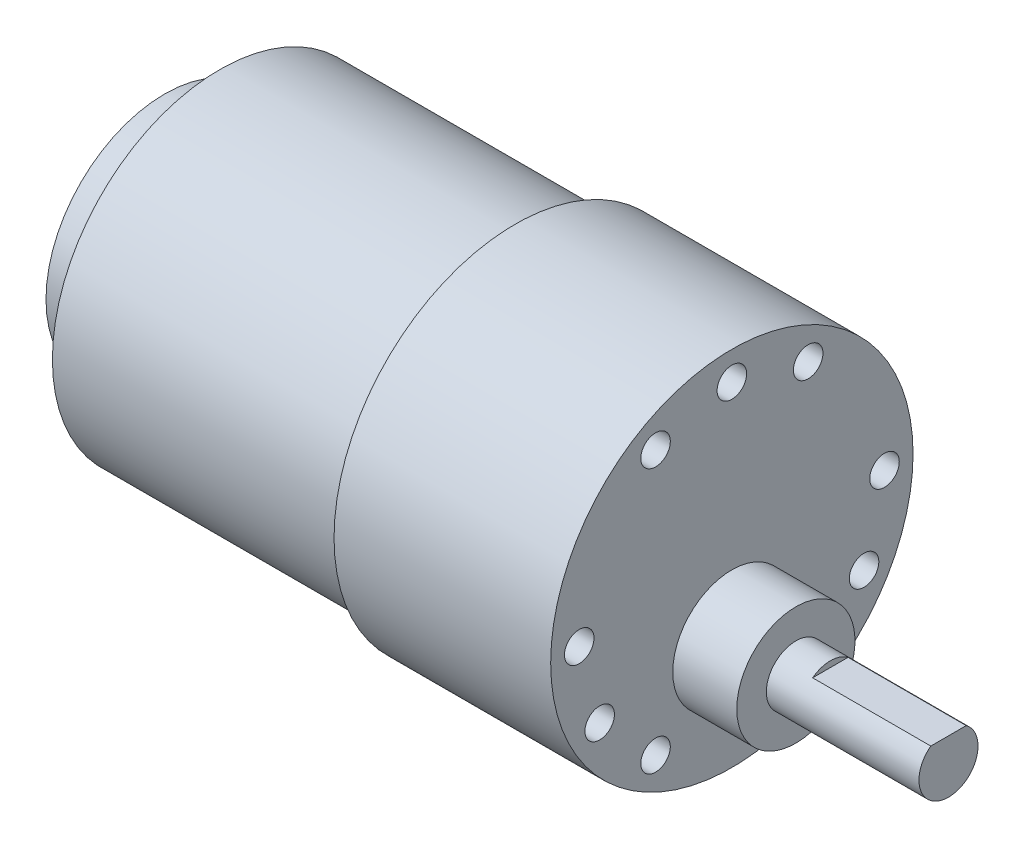
ISO-10303-21;
HEADER;
FILE_DESCRIPTION(('STEP AP214'),'2;1');
FILE_NAME('part.step','',(''),(''),'','','');
FILE_SCHEMA(('AUTOMOTIVE_DESIGN { 1 0 10303 214 1 1 1 1 }'));
ENDSEC;
DATA;
#1=APPLICATION_CONTEXT('core data for automotive mechanical design processes');
#2=APPLICATION_PROTOCOL_DEFINITION('international standard','automotive_design',2000,#1);
#3=PRODUCT_CONTEXT('',#1,'mechanical');
#4=PRODUCT('Part','Part','',(#3));
#5=PRODUCT_RELATED_PRODUCT_CATEGORY('part','',(#4));
#6=PRODUCT_DEFINITION_FORMATION('','',#4);
#7=PRODUCT_DEFINITION_CONTEXT('part definition',#1,'design');
#8=PRODUCT_DEFINITION('design','',#6,#7);
#9=PRODUCT_DEFINITION_SHAPE('','',#8);
#10=(LENGTH_UNIT() NAMED_UNIT(*) SI_UNIT(.MILLI.,.METRE.));
#11=(NAMED_UNIT(*) PLANE_ANGLE_UNIT() SI_UNIT($,.RADIAN.));
#12=(NAMED_UNIT(*) SI_UNIT($,.STERADIAN.) SOLID_ANGLE_UNIT());
#13=UNCERTAINTY_MEASURE_WITH_UNIT(LENGTH_MEASURE(1.E-05),#10,'distance_accuracy_value','');
#14=(GEOMETRIC_REPRESENTATION_CONTEXT(3) GLOBAL_UNCERTAINTY_ASSIGNED_CONTEXT((#13)) GLOBAL_UNIT_ASSIGNED_CONTEXT((#10,
#11,#12)) REPRESENTATION_CONTEXT('',''));
#15=CARTESIAN_POINT('',(0.,0.,0.));
#16=DIRECTION('',(0.,0.,1.));
#17=DIRECTION('',(1.,0.,0.));
#18=AXIS2_PLACEMENT_3D('',#15,#16,#17);
#19=CARTESIAN_POINT('',(-30.,0.,0.));
#20=DIRECTION('',(1.,0.,0.));
#21=DIRECTION('',(0.,0.,-1.));
#22=AXIS2_PLACEMENT_3D('',#19,#20,#21);
#23=PLANE('',#22);
#24=CARTESIAN_POINT('',(-30.,0.,0.));
#25=DIRECTION('',(-1.,0.,0.));
#26=DIRECTION('',(0.,0.,1.));
#27=AXIS2_PLACEMENT_3D('',#24,#25,#26);
#28=CIRCLE('',#27,17.);
#29=CARTESIAN_POINT('',(-30.,0.,17.));
#30=VERTEX_POINT('',#29);
#31=EDGE_CURVE('E91',#30,#30,#28,.T.);
#32=ORIENTED_EDGE('',*,*,#31,.T.);
#33=EDGE_LOOP('',(#32));
#34=FACE_BOUND('',#33,.T.);
#35=CARTESIAN_POINT('',(-30.,0.,0.));
#36=DIRECTION('',(1.,0.,0.));
#37=DIRECTION('',(0.,0.,-1.));
#38=AXIS2_PLACEMENT_3D('',#35,#36,#37);
#39=CIRCLE('',#38,12.05);
#40=CARTESIAN_POINT('',(-30.,0.,-12.05));
#41=VERTEX_POINT('',#40);
#42=EDGE_CURVE('E11',#41,#41,#39,.F.);
#43=ORIENTED_EDGE('',*,*,#42,.F.);
#44=EDGE_LOOP('',(#43));
#45=FACE_BOUND('',#44,.T.);
#46=ADVANCED_FACE('F32',(#34,#45),#23,.F.);
#47=CARTESIAN_POINT('',(8.41072503063725,-7.,0.));
#48=DIRECTION('',(-1.,0.,0.));
#49=DIRECTION('',(0.,0.,1.));
#50=AXIS2_PLACEMENT_3D('',#47,#48,#49);
#51=CYLINDRICAL_SURFACE('',#50,3.);
#52=CARTESIAN_POINT('',(28.5,-7.,0.));
#53=DIRECTION('',(-1.,0.,0.));
#54=DIRECTION('',(0.,0.,1.));
#55=AXIS2_PLACEMENT_3D('',#52,#53,#54);
#56=CIRCLE('',#55,3.);
#57=CARTESIAN_POINT('',(28.5,-7.,3.));
#58=VERTEX_POINT('',#57);
#59=EDGE_CURVE('E76',#58,#58,#56,.T.);
#60=ORIENTED_EDGE('',*,*,#59,.F.);
#61=EDGE_LOOP('',(#60));
#62=FACE_BOUND('',#61,.T.);
#63=DIRECTION('',(-1.,0.,0.));
#64=VECTOR('',#63,1.);
#65=CARTESIAN_POINT('',(8.41072503063725,-4.6,-1.8));
#66=LINE('',#65,#64);
#67=CARTESIAN_POINT('',(44.,-4.6,-1.8));
#68=VERTEX_POINT('',#67);
#69=CARTESIAN_POINT('',(32.,-4.6,-1.8));
#70=VERTEX_POINT('',#69);
#71=EDGE_CURVE('E64',#68,#70,#66,.T.);
#72=ORIENTED_EDGE('',*,*,#71,.F.);
#73=CARTESIAN_POINT('',(44.,-7.,0.));
#74=DIRECTION('',(-1.,0.,0.));
#75=DIRECTION('',(0.,0.,1.));
#76=AXIS2_PLACEMENT_3D('',#73,#74,#75);
#77=CIRCLE('',#76,3.);
#78=CARTESIAN_POINT('',(44.,-4.6,1.8));
#79=VERTEX_POINT('',#78);
#80=EDGE_CURVE('E70',#68,#79,#77,.T.);
#81=ORIENTED_EDGE('',*,*,#80,.T.);
#82=DIRECTION('',(-1.,0.,0.));
#83=VECTOR('',#82,1.);
#84=CARTESIAN_POINT('',(8.41072503063725,-4.6,1.8));
#85=LINE('',#84,#83);
#86=CARTESIAN_POINT('',(32.,-4.6,1.8));
#87=VERTEX_POINT('',#86);
#88=EDGE_CURVE('E47',#87,#79,#85,.F.);
#89=ORIENTED_EDGE('',*,*,#88,.F.);
#90=CARTESIAN_POINT('',(32.,-7.,0.));
#91=DIRECTION('',(1.,0.,0.));
#92=DIRECTION('',(0.,0.,-1.));
#93=AXIS2_PLACEMENT_3D('',#90,#91,#92);
#94=CIRCLE('',#93,3.);
#95=EDGE_CURVE('E40',#70,#87,#94,.T.);
#96=ORIENTED_EDGE('',*,*,#95,.F.);
#97=EDGE_LOOP('',(#72,#81,#89,#96));
#98=FACE_BOUND('',#97,.T.);
#99=ADVANCED_FACE('F68',(#62,#98),#51,.T.);
#100=CARTESIAN_POINT('',(44.,-4.00000000000001,0.));
#101=DIRECTION('',(-1.,0.,0.));
#102=DIRECTION('',(0.,0.,1.));
#103=AXIS2_PLACEMENT_3D('',#100,#101,#102);
#104=PLANE('',#103);
#105=DIRECTION('',(0.,0.,-1.));
#106=VECTOR('',#105,1.);
#107=CARTESIAN_POINT('',(44.,-4.6,0.));
#108=LINE('',#107,#106);
#109=EDGE_CURVE('E51',#79,#68,#108,.T.);
#110=ORIENTED_EDGE('',*,*,#109,.F.);
#111=ORIENTED_EDGE('',*,*,#80,.F.);
#112=EDGE_LOOP('',(#110,#111));
#113=FACE_BOUND('',#112,.T.);
#114=ADVANCED_FACE('F105',(#113),#104,.F.);
#115=CARTESIAN_POINT('',(22.,18.4,0.));
#116=DIRECTION('',(-1.,0.,0.));
#117=DIRECTION('',(0.,0.,1.));
#118=AXIS2_PLACEMENT_3D('',#115,#116,#117);
#119=PLANE('',#118);
#120=CARTESIAN_POINT('',(22.,-13.4233937586587,7.7500000000002));
#121=DIRECTION('',(1.,0.,0.));
#122=DIRECTION('',(0.,0.866025403784443,0.499999999999992));
#123=AXIS2_PLACEMENT_3D('',#120,#121,#122);
#124=CIRCLE('',#123,1.5);
#125=CARTESIAN_POINT('',(22.,-12.124355652982,8.50000000000019));
#126=VERTEX_POINT('',#125);
#127=EDGE_CURVE('E444',#126,#126,#124,.T.);
#128=ORIENTED_EDGE('',*,*,#127,.F.);
#129=EDGE_LOOP('',(#128));
#130=FACE_BOUND('',#129,.T.);
#131=CARTESIAN_POINT('',(22.,0.,15.5));
#132=DIRECTION('',(1.,0.,0.));
#133=DIRECTION('',(0.,0.866025403784443,0.499999999999992));
#134=AXIS2_PLACEMENT_3D('',#131,#132,#133);
#135=CIRCLE('',#134,1.5);
#136=CARTESIAN_POINT('',(22.,1.29903810567671,16.25));
#137=VERTEX_POINT('',#136);
#138=EDGE_CURVE('E443',#137,#137,#135,.T.);
#139=ORIENTED_EDGE('',*,*,#138,.F.);
#140=EDGE_LOOP('',(#139));
#141=FACE_BOUND('',#140,.T.);
#142=CARTESIAN_POINT('',(22.,-7.74999999999987,13.4233937586589));
#143=DIRECTION('',(1.,0.,0.));
#144=DIRECTION('',(0.,0.866025403784443,0.499999999999992));
#145=AXIS2_PLACEMENT_3D('',#142,#143,#144);
#146=CIRCLE('',#145,1.5);
#147=CARTESIAN_POINT('',(22.,-6.45096189432321,14.1733937586589));
#148=VERTEX_POINT('',#147);
#149=EDGE_CURVE('E453',#148,#148,#146,.T.);
#150=ORIENTED_EDGE('',*,*,#149,.F.);
#151=EDGE_LOOP('',(#150));
#152=FACE_BOUND('',#151,.T.);
#153=CARTESIAN_POINT('',(22.,-1.60461921527855E-13,-15.5));
#154=DIRECTION('',(1.,0.,0.));
#155=DIRECTION('',(0.,-0.866025403784436,0.500000000000004));
#156=AXIS2_PLACEMENT_3D('',#153,#154,#155);
#157=CIRCLE('',#156,1.5);
#158=CARTESIAN_POINT('',(22.,-1.29903810567682,-14.75));
#159=VERTEX_POINT('',#158);
#160=EDGE_CURVE('E458',#159,#159,#157,.T.);
#161=ORIENTED_EDGE('',*,*,#160,.F.);
#162=EDGE_LOOP('',(#161));
#163=FACE_BOUND('',#162,.T.);
#164=CARTESIAN_POINT('',(22.,-13.4233937586588,-7.75000000000002));
#165=DIRECTION('',(1.,0.,0.));
#166=DIRECTION('',(0.,-0.866025403784436,0.500000000000004));
#167=AXIS2_PLACEMENT_3D('',#164,#165,#166);
#168=CIRCLE('',#167,1.5);
#169=CARTESIAN_POINT('',(22.,-14.7224318643354,-7.00000000000002));
#170=VERTEX_POINT('',#169);
#171=EDGE_CURVE('E464',#170,#170,#168,.T.);
#172=ORIENTED_EDGE('',*,*,#171,.F.);
#173=EDGE_LOOP('',(#172));
#174=FACE_BOUND('',#173,.T.);
#175=CARTESIAN_POINT('',(22.,-7.75000000000006,-13.4233937586588));
#176=DIRECTION('',(1.,0.,0.));
#177=DIRECTION('',(0.,-0.866025403784436,0.500000000000004));
#178=AXIS2_PLACEMENT_3D('',#175,#176,#177);
#179=CIRCLE('',#178,1.5);
#180=CARTESIAN_POINT('',(22.,-9.04903810567672,-12.6733937586588));
#181=VERTEX_POINT('',#180);
#182=EDGE_CURVE('E470',#181,#181,#179,.T.);
#183=ORIENTED_EDGE('',*,*,#182,.F.);
#184=EDGE_LOOP('',(#183));
#185=FACE_BOUND('',#184,.T.);
#186=CARTESIAN_POINT('',(22.,13.4233937586588,7.74999999999992));
#187=DIRECTION('',(1.,0.,0.));
#188=DIRECTION('',(0.,0.,-1.));
#189=AXIS2_PLACEMENT_3D('',#186,#187,#188);
#190=CIRCLE('',#189,1.5);
#191=CARTESIAN_POINT('',(22.,13.4233937586588,6.24999999999992));
#192=VERTEX_POINT('',#191);
#193=EDGE_CURVE('E476',#192,#192,#190,.T.);
#194=ORIENTED_EDGE('',*,*,#193,.F.);
#195=EDGE_LOOP('',(#194));
#196=FACE_BOUND('',#195,.T.);
#197=CARTESIAN_POINT('',(22.,13.4233937586588,-7.74999999999992));
#198=DIRECTION('',(1.,0.,0.));
#199=DIRECTION('',(0.,0.,-1.));
#200=AXIS2_PLACEMENT_3D('',#197,#198,#199);
#201=CIRCLE('',#200,1.5);
#202=CARTESIAN_POINT('',(22.,13.4233937586588,-9.24999999999992));
#203=VERTEX_POINT('',#202);
#204=EDGE_CURVE('E482',#203,#203,#201,.T.);
#205=ORIENTED_EDGE('',*,*,#204,.F.);
#206=EDGE_LOOP('',(#205));
#207=FACE_BOUND('',#206,.T.);
#208=CARTESIAN_POINT('',(22.,15.5,0.));
#209=DIRECTION('',(1.,0.,0.));
#210=DIRECTION('',(0.,0.,-1.));
#211=AXIS2_PLACEMENT_3D('',#208,#209,#210);
#212=CIRCLE('',#211,1.5);
#213=CARTESIAN_POINT('',(22.,15.5,-1.5));
#214=VERTEX_POINT('',#213);
#215=EDGE_CURVE('E152',#214,#214,#212,.T.);
#216=ORIENTED_EDGE('',*,*,#215,.F.);
#217=EDGE_LOOP('',(#216));
#218=FACE_BOUND('',#217,.T.);
#219=CARTESIAN_POINT('',(22.,0.,0.));
#220=DIRECTION('',(-1.,0.,0.));
#221=DIRECTION('',(0.,0.,1.));
#222=AXIS2_PLACEMENT_3D('',#219,#220,#221);
#223=CIRCLE('',#222,18.4);
#224=CARTESIAN_POINT('',(22.,0.,18.4));
#225=VERTEX_POINT('',#224);
#226=EDGE_CURVE('E82',#225,#225,#223,.T.);
#227=ORIENTED_EDGE('',*,*,#226,.F.);
#228=EDGE_LOOP('',(#227));
#229=FACE_BOUND('',#228,.T.);
#230=CARTESIAN_POINT('',(22.,-7.,0.));
#231=DIRECTION('',(-1.,0.,0.));
#232=DIRECTION('',(0.,0.,1.));
#233=AXIS2_PLACEMENT_3D('',#230,#231,#232);
#234=CIRCLE('',#233,6.);
#235=CARTESIAN_POINT('',(22.,-7.,6.));
#236=VERTEX_POINT('',#235);
#237=EDGE_CURVE('E94',#236,#236,#234,.F.);
#238=ORIENTED_EDGE('',*,*,#237,.F.);
#239=EDGE_LOOP('',(#238));
#240=FACE_BOUND('',#239,.T.);
#241=ADVANCED_FACE('F102',(#130,#141,#152,#163,#174,#185,#196,#207,#218,#229,#240),#119,.F.);
#242=CARTESIAN_POINT('',(-59.1178385416667,0.,0.));
#243=DIRECTION('',(-1.,0.,0.));
#244=DIRECTION('',(0.,0.,1.));
#245=AXIS2_PLACEMENT_3D('',#242,#243,#244);
#246=CYLINDRICAL_SURFACE('',#245,17.);
#247=ORIENTED_EDGE('',*,*,#31,.F.);
#248=EDGE_LOOP('',(#247));
#249=FACE_BOUND('',#248,.T.);
#250=CARTESIAN_POINT('',(0.,0.,0.));
#251=DIRECTION('',(-1.,0.,0.));
#252=DIRECTION('',(0.,0.,1.));
#253=AXIS2_PLACEMENT_3D('',#250,#251,#252);
#254=CIRCLE('',#253,17.);
#255=CARTESIAN_POINT('',(0.,0.,17.));
#256=VERTEX_POINT('',#255);
#257=EDGE_CURVE('E88',#256,#256,#254,.T.);
#258=ORIENTED_EDGE('',*,*,#257,.T.);
#259=EDGE_LOOP('',(#258));
#260=FACE_BOUND('',#259,.T.);
#261=ADVANCED_FACE('F104',(#249,#260),#246,.T.);
#262=CARTESIAN_POINT('',(0.,17.,0.));
#263=DIRECTION('',(1.,0.,0.));
#264=DIRECTION('',(0.,0.,-1.));
#265=AXIS2_PLACEMENT_3D('',#262,#263,#264);
#266=PLANE('',#265);
#267=ORIENTED_EDGE('',*,*,#257,.F.);
#268=EDGE_LOOP('',(#267));
#269=FACE_BOUND('',#268,.T.);
#270=CARTESIAN_POINT('',(0.,0.,0.));
#271=DIRECTION('',(-1.,0.,0.));
#272=DIRECTION('',(0.,0.,1.));
#273=AXIS2_PLACEMENT_3D('',#270,#271,#272);
#274=CIRCLE('',#273,18.4);
#275=CARTESIAN_POINT('',(0.,0.,18.4));
#276=VERTEX_POINT('',#275);
#277=EDGE_CURVE('E85',#276,#276,#274,.T.);
#278=ORIENTED_EDGE('',*,*,#277,.T.);
#279=EDGE_LOOP('',(#278));
#280=FACE_BOUND('',#279,.T.);
#281=ADVANCED_FACE('F112',(#269,#280),#266,.F.);
#282=CARTESIAN_POINT('',(-59.1178385416667,0.,0.));
#283=DIRECTION('',(-1.,0.,0.));
#284=DIRECTION('',(0.,0.,1.));
#285=AXIS2_PLACEMENT_3D('',#282,#283,#284);
#286=CYLINDRICAL_SURFACE('',#285,18.4);
#287=ORIENTED_EDGE('',*,*,#277,.F.);
#288=EDGE_LOOP('',(#287));
#289=FACE_BOUND('',#288,.T.);
#290=ORIENTED_EDGE('',*,*,#226,.T.);
#291=EDGE_LOOP('',(#290));
#292=FACE_BOUND('',#291,.T.);
#293=ADVANCED_FACE('F178',(#289,#292),#286,.T.);
#294=CARTESIAN_POINT('',(8.41072503063725,-7.,0.));
#295=DIRECTION('',(-1.,0.,0.));
#296=DIRECTION('',(0.,0.,1.));
#297=AXIS2_PLACEMENT_3D('',#294,#295,#296);
#298=CYLINDRICAL_SURFACE('',#297,6.);
#299=ORIENTED_EDGE('',*,*,#237,.T.);
#300=EDGE_LOOP('',(#299));
#301=FACE_BOUND('',#300,.T.);
#302=CARTESIAN_POINT('',(28.5,-7.,0.));
#303=DIRECTION('',(-1.,0.,0.));
#304=DIRECTION('',(0.,0.,1.));
#305=AXIS2_PLACEMENT_3D('',#302,#303,#304);
#306=CIRCLE('',#305,6.);
#307=CARTESIAN_POINT('',(28.5,-7.,6.));
#308=VERTEX_POINT('',#307);
#309=EDGE_CURVE('E79',#308,#308,#306,.T.);
#310=ORIENTED_EDGE('',*,*,#309,.T.);
#311=EDGE_LOOP('',(#310));
#312=FACE_BOUND('',#311,.T.);
#313=ADVANCED_FACE('F99',(#301,#312),#298,.T.);
#314=CARTESIAN_POINT('',(28.5,-1.,0.));
#315=DIRECTION('',(-1.,0.,0.));
#316=DIRECTION('',(0.,0.,1.));
#317=AXIS2_PLACEMENT_3D('',#314,#315,#316);
#318=PLANE('',#317);
#319=ORIENTED_EDGE('',*,*,#309,.F.);
#320=EDGE_LOOP('',(#319));
#321=FACE_BOUND('',#320,.T.);
#322=ORIENTED_EDGE('',*,*,#59,.T.);
#323=EDGE_LOOP('',(#322));
#324=FACE_BOUND('',#323,.T.);
#325=ADVANCED_FACE('F173',(#321,#324),#318,.F.);
#326=CARTESIAN_POINT('',(32.,6.87018499999999,10.));
#327=DIRECTION('',(1.,0.,0.));
#328=DIRECTION('',(0.,0.,-1.));
#329=AXIS2_PLACEMENT_3D('',#326,#327,#328);
#330=PLANE('',#329);
#331=ORIENTED_EDGE('',*,*,#95,.T.);
#332=DIRECTION('',(0.,0.,-1.));
#333=VECTOR('',#332,1.);
#334=CARTESIAN_POINT('',(32.,-4.6,10.));
#335=LINE('',#334,#333);
#336=EDGE_CURVE('E61',#87,#70,#335,.T.);
#337=ORIENTED_EDGE('',*,*,#336,.T.);
#338=EDGE_LOOP('',(#331,#337));
#339=FACE_BOUND('',#338,.T.);
#340=ADVANCED_FACE('F60',(#339),#330,.T.);
#341=CARTESIAN_POINT('',(32.,-4.6,10.));
#342=DIRECTION('',(0.,1.,0.));
#343=DIRECTION('',(0.,0.,1.));
#344=AXIS2_PLACEMENT_3D('',#341,#342,#343);
#345=PLANE('',#344);
#346=ORIENTED_EDGE('',*,*,#71,.T.);
#347=ORIENTED_EDGE('',*,*,#336,.F.);
#348=ORIENTED_EDGE('',*,*,#88,.T.);
#349=ORIENTED_EDGE('',*,*,#109,.T.);
#350=EDGE_LOOP('',(#346,#347,#348,#349));
#351=FACE_BOUND('',#350,.T.);
#352=ADVANCED_FACE('F63',(#351),#345,.T.);
#353=CARTESIAN_POINT('',(-35.6,0.,0.));
#354=DIRECTION('',(-1.,0.,0.));
#355=DIRECTION('',(0.,0.,1.));
#356=AXIS2_PLACEMENT_3D('',#353,#354,#355);
#357=PLANE('',#356);
#358=CARTESIAN_POINT('',(-35.6,0.,0.));
#359=DIRECTION('',(-1.,0.,0.));
#360=DIRECTION('',(0.,0.,1.));
#361=AXIS2_PLACEMENT_3D('',#358,#359,#360);
#362=CIRCLE('',#361,12.05);
#363=CARTESIAN_POINT('',(-35.6,0.,12.05));
#364=VERTEX_POINT('',#363);
#365=EDGE_CURVE('E65',#364,#364,#362,.T.);
#366=ORIENTED_EDGE('',*,*,#365,.T.);
#367=EDGE_LOOP('',(#366));
#368=FACE_BOUND('',#367,.T.);
#369=CARTESIAN_POINT('',(-35.6,0.,0.));
#370=DIRECTION('',(-1.,0.,0.));
#371=DIRECTION('',(0.,0.,1.));
#372=AXIS2_PLACEMENT_3D('',#369,#370,#371);
#373=CIRCLE('',#372,11.9);
#374=CARTESIAN_POINT('',(-35.6,0.,11.9));
#375=VERTEX_POINT('',#374);
#376=EDGE_CURVE('E146',#375,#375,#373,.T.);
#377=ORIENTED_EDGE('',*,*,#376,.F.);
#378=EDGE_LOOP('',(#377));
#379=FACE_BOUND('',#378,.T.);
#380=ADVANCED_FACE('F158',(#368,#379),#357,.T.);
#381=CARTESIAN_POINT('',(-35.6,0.,0.));
#382=DIRECTION('',(1.,0.,0.));
#383=DIRECTION('',(0.,0.,-1.));
#384=AXIS2_PLACEMENT_3D('',#381,#382,#383);
#385=CYLINDRICAL_SURFACE('',#384,12.05);
#386=ORIENTED_EDGE('',*,*,#365,.F.);
#387=EDGE_LOOP('',(#386));
#388=FACE_BOUND('',#387,.T.);
#389=ORIENTED_EDGE('',*,*,#42,.T.);
#390=EDGE_LOOP('',(#389));
#391=FACE_BOUND('',#390,.T.);
#392=ADVANCED_FACE('F139',(#388,#391),#385,.T.);
#393=CARTESIAN_POINT('',(-35.6,0.,0.));
#394=DIRECTION('',(1.,0.,0.));
#395=DIRECTION('',(0.,0.,-1.));
#396=AXIS2_PLACEMENT_3D('',#393,#394,#395);
#397=CYLINDRICAL_SURFACE('',#396,11.9);
#398=ORIENTED_EDGE('',*,*,#376,.T.);
#399=EDGE_LOOP('',(#398));
#400=FACE_BOUND('',#399,.T.);
#401=CARTESIAN_POINT('',(-30.,0.,0.));
#402=DIRECTION('',(-1.,0.,0.));
#403=DIRECTION('',(0.,0.,1.));
#404=AXIS2_PLACEMENT_3D('',#401,#402,#403);
#405=CIRCLE('',#404,11.9);
#406=CARTESIAN_POINT('',(-30.,0.,11.9));
#407=VERTEX_POINT('',#406);
#408=EDGE_CURVE('E144',#407,#407,#405,.T.);
#409=ORIENTED_EDGE('',*,*,#408,.F.);
#410=EDGE_LOOP('',(#409));
#411=FACE_BOUND('',#410,.T.);
#412=ADVANCED_FACE('F130',(#400,#411),#397,.F.);
#413=ORIENTED_EDGE('',*,*,#408,.T.);
#414=EDGE_LOOP('',(#413));
#415=FACE_BOUND('',#414,.T.);
#416=ADVANCED_FACE('F34',(#415),#23,.F.);
#417=CARTESIAN_POINT('',(17.,15.5,0.));
#418=DIRECTION('',(1.,0.,0.));
#419=DIRECTION('',(0.,0.,-1.));
#420=AXIS2_PLACEMENT_3D('',#417,#418,#419);
#421=CYLINDRICAL_SURFACE('',#420,1.5);
#422=CARTESIAN_POINT('',(17.,15.5,0.));
#423=DIRECTION('',(1.,0.,0.));
#424=DIRECTION('',(0.,0.,-1.));
#425=AXIS2_PLACEMENT_3D('',#422,#423,#424);
#426=CIRCLE('',#425,1.5);
#427=CARTESIAN_POINT('',(17.,15.5,-1.5));
#428=VERTEX_POINT('',#427);
#429=EDGE_CURVE('E147',#428,#428,#426,.T.);
#430=ORIENTED_EDGE('',*,*,#429,.F.);
#431=EDGE_LOOP('',(#430));
#432=FACE_BOUND('',#431,.T.);
#433=ORIENTED_EDGE('',*,*,#215,.T.);
#434=EDGE_LOOP('',(#433));
#435=FACE_BOUND('',#434,.T.);
#436=ADVANCED_FACE('F129',(#432,#435),#421,.F.);
#437=CARTESIAN_POINT('',(17.,15.5,0.));
#438=DIRECTION('',(1.,0.,0.));
#439=DIRECTION('',(0.,0.,-1.));
#440=AXIS2_PLACEMENT_3D('',#437,#438,#439);
#441=PLANE('',#440);
#442=ORIENTED_EDGE('',*,*,#429,.T.);
#443=EDGE_LOOP('',(#442));
#444=FACE_BOUND('',#443,.T.);
#445=ADVANCED_FACE('F136',(#444),#441,.T.);
#446=CARTESIAN_POINT('',(17.,13.4233937586588,-7.74999999999992));
#447=DIRECTION('',(1.,0.,0.));
#448=DIRECTION('',(0.,0.,-1.));
#449=AXIS2_PLACEMENT_3D('',#446,#447,#448);
#450=CYLINDRICAL_SURFACE('',#449,1.5);
#451=CARTESIAN_POINT('',(17.,13.4233937586588,-7.74999999999992));
#452=DIRECTION('',(1.,0.,0.));
#453=DIRECTION('',(0.,0.,-1.));
#454=AXIS2_PLACEMENT_3D('',#451,#452,#453);
#455=CIRCLE('',#454,1.5);
#456=CARTESIAN_POINT('',(17.,13.4233937586588,-9.24999999999992));
#457=VERTEX_POINT('',#456);
#458=EDGE_CURVE('E485',#457,#457,#455,.T.);
#459=ORIENTED_EDGE('',*,*,#458,.F.);
#460=EDGE_LOOP('',(#459));
#461=FACE_BOUND('',#460,.T.);
#462=ORIENTED_EDGE('',*,*,#204,.T.);
#463=EDGE_LOOP('',(#462));
#464=FACE_BOUND('',#463,.T.);
#465=ADVANCED_FACE('F278',(#461,#464),#450,.F.);
#466=CARTESIAN_POINT('',(17.,13.4233937586588,-7.74999999999992));
#467=DIRECTION('',(1.,0.,0.));
#468=DIRECTION('',(0.,0.,-1.));
#469=AXIS2_PLACEMENT_3D('',#466,#467,#468);
#470=PLANE('',#469);
#471=ORIENTED_EDGE('',*,*,#458,.T.);
#472=EDGE_LOOP('',(#471));
#473=FACE_BOUND('',#472,.T.);
#474=ADVANCED_FACE('F287',(#473),#470,.T.);
#475=CARTESIAN_POINT('',(17.,13.4233937586588,7.74999999999992));
#476=DIRECTION('',(1.,0.,0.));
#477=DIRECTION('',(0.,0.,-1.));
#478=AXIS2_PLACEMENT_3D('',#475,#476,#477);
#479=CYLINDRICAL_SURFACE('',#478,1.5);
#480=CARTESIAN_POINT('',(17.,13.4233937586588,7.74999999999992));
#481=DIRECTION('',(1.,0.,0.));
#482=DIRECTION('',(0.,0.,-1.));
#483=AXIS2_PLACEMENT_3D('',#480,#481,#482);
#484=CIRCLE('',#483,1.5);
#485=CARTESIAN_POINT('',(17.,13.4233937586588,6.24999999999992));
#486=VERTEX_POINT('',#485);
#487=EDGE_CURVE('E479',#486,#486,#484,.T.);
#488=ORIENTED_EDGE('',*,*,#487,.F.);
#489=EDGE_LOOP('',(#488));
#490=FACE_BOUND('',#489,.T.);
#491=ORIENTED_EDGE('',*,*,#193,.T.);
#492=EDGE_LOOP('',(#491));
#493=FACE_BOUND('',#492,.T.);
#494=ADVANCED_FACE('F296',(#490,#493),#479,.F.);
#495=CARTESIAN_POINT('',(17.,13.4233937586588,7.74999999999992));
#496=DIRECTION('',(1.,0.,0.));
#497=DIRECTION('',(0.,0.,-1.));
#498=AXIS2_PLACEMENT_3D('',#495,#496,#497);
#499=PLANE('',#498);
#500=ORIENTED_EDGE('',*,*,#487,.T.);
#501=EDGE_LOOP('',(#500));
#502=FACE_BOUND('',#501,.T.);
#503=ADVANCED_FACE('F305',(#502),#499,.T.);
#504=CARTESIAN_POINT('',(17.,-7.75000000000006,-13.4233937586588));
#505=DIRECTION('',(1.,0.,0.));
#506=DIRECTION('',(0.,0.,-1.));
#507=AXIS2_PLACEMENT_3D('',#504,#505,#506);
#508=CYLINDRICAL_SURFACE('',#507,1.5);
#509=CARTESIAN_POINT('',(17.,-7.75000000000006,-13.4233937586588));
#510=DIRECTION('',(1.,0.,0.));
#511=DIRECTION('',(0.,-0.866025403784436,0.500000000000004));
#512=AXIS2_PLACEMENT_3D('',#509,#510,#511);
#513=CIRCLE('',#512,1.5);
#514=CARTESIAN_POINT('',(17.,-9.04903810567672,-12.6733937586588));
#515=VERTEX_POINT('',#514);
#516=EDGE_CURVE('E473',#515,#515,#513,.T.);
#517=ORIENTED_EDGE('',*,*,#516,.F.);
#518=EDGE_LOOP('',(#517));
#519=FACE_BOUND('',#518,.T.);
#520=ORIENTED_EDGE('',*,*,#182,.T.);
#521=EDGE_LOOP('',(#520));
#522=FACE_BOUND('',#521,.T.);
#523=ADVANCED_FACE('F313',(#519,#522),#508,.F.);
#524=CARTESIAN_POINT('',(17.,-7.75000000000006,-13.4233937586588));
#525=DIRECTION('',(1.,0.,0.));
#526=DIRECTION('',(0.,-0.866025403784436,0.500000000000004));
#527=AXIS2_PLACEMENT_3D('',#524,#525,#526);
#528=PLANE('',#527);
#529=ORIENTED_EDGE('',*,*,#516,.T.);
#530=EDGE_LOOP('',(#529));
#531=FACE_BOUND('',#530,.T.);
#532=ADVANCED_FACE('F321',(#531),#528,.T.);
#533=CARTESIAN_POINT('',(17.,-13.4233937586588,-7.75000000000002));
#534=DIRECTION('',(1.,0.,0.));
#535=DIRECTION('',(0.,0.,-1.));
#536=AXIS2_PLACEMENT_3D('',#533,#534,#535);
#537=CYLINDRICAL_SURFACE('',#536,1.5);
#538=CARTESIAN_POINT('',(17.,-13.4233937586588,-7.75000000000002));
#539=DIRECTION('',(1.,0.,0.));
#540=DIRECTION('',(0.,-0.866025403784436,0.500000000000004));
#541=AXIS2_PLACEMENT_3D('',#538,#539,#540);
#542=CIRCLE('',#541,1.5);
#543=CARTESIAN_POINT('',(17.,-14.7224318643354,-7.00000000000002));
#544=VERTEX_POINT('',#543);
#545=EDGE_CURVE('E467',#544,#544,#542,.T.);
#546=ORIENTED_EDGE('',*,*,#545,.F.);
#547=EDGE_LOOP('',(#546));
#548=FACE_BOUND('',#547,.T.);
#549=ORIENTED_EDGE('',*,*,#171,.T.);
#550=EDGE_LOOP('',(#549));
#551=FACE_BOUND('',#550,.T.);
#552=ADVANCED_FACE('F330',(#548,#551),#537,.F.);
#553=CARTESIAN_POINT('',(17.,-13.4233937586588,-7.75000000000002));
#554=DIRECTION('',(1.,0.,0.));
#555=DIRECTION('',(0.,-0.866025403784436,0.500000000000004));
#556=AXIS2_PLACEMENT_3D('',#553,#554,#555);
#557=PLANE('',#556);
#558=ORIENTED_EDGE('',*,*,#545,.T.);
#559=EDGE_LOOP('',(#558));
#560=FACE_BOUND('',#559,.T.);
#561=ADVANCED_FACE('F339',(#560),#557,.T.);
#562=CARTESIAN_POINT('',(17.,-1.60461921527855E-13,-15.5));
#563=DIRECTION('',(1.,0.,0.));
#564=DIRECTION('',(0.,0.,-1.));
#565=AXIS2_PLACEMENT_3D('',#562,#563,#564);
#566=CYLINDRICAL_SURFACE('',#565,1.5);
#567=CARTESIAN_POINT('',(17.,-1.60461921527855E-13,-15.5));
#568=DIRECTION('',(1.,0.,0.));
#569=DIRECTION('',(0.,-0.866025403784436,0.500000000000004));
#570=AXIS2_PLACEMENT_3D('',#567,#568,#569);
#571=CIRCLE('',#570,1.5);
#572=CARTESIAN_POINT('',(17.,-1.29903810567682,-14.75));
#573=VERTEX_POINT('',#572);
#574=EDGE_CURVE('E461',#573,#573,#571,.T.);
#575=ORIENTED_EDGE('',*,*,#574,.F.);
#576=EDGE_LOOP('',(#575));
#577=FACE_BOUND('',#576,.T.);
#578=ORIENTED_EDGE('',*,*,#160,.T.);
#579=EDGE_LOOP('',(#578));
#580=FACE_BOUND('',#579,.T.);
#581=ADVANCED_FACE('F348',(#577,#580),#566,.F.);
#582=CARTESIAN_POINT('',(17.,-1.60461921527855E-13,-15.5));
#583=DIRECTION('',(1.,0.,0.));
#584=DIRECTION('',(0.,-0.866025403784436,0.500000000000004));
#585=AXIS2_PLACEMENT_3D('',#582,#583,#584);
#586=PLANE('',#585);
#587=ORIENTED_EDGE('',*,*,#574,.T.);
#588=EDGE_LOOP('',(#587));
#589=FACE_BOUND('',#588,.T.);
#590=ADVANCED_FACE('F357',(#589),#586,.T.);
#591=CARTESIAN_POINT('',(17.,-7.74999999999987,13.4233937586589));
#592=DIRECTION('',(1.,0.,0.));
#593=DIRECTION('',(0.,0.,-1.));
#594=AXIS2_PLACEMENT_3D('',#591,#592,#593);
#595=CYLINDRICAL_SURFACE('',#594,1.5);
#596=CARTESIAN_POINT('',(17.,-7.74999999999987,13.4233937586589));
#597=DIRECTION('',(1.,0.,0.));
#598=DIRECTION('',(0.,0.866025403784443,0.499999999999992));
#599=AXIS2_PLACEMENT_3D('',#596,#597,#598);
#600=CIRCLE('',#599,1.5);
#601=CARTESIAN_POINT('',(17.,-6.45096189432321,14.1733937586589));
#602=VERTEX_POINT('',#601);
#603=EDGE_CURVE('E455',#602,#602,#600,.T.);
#604=ORIENTED_EDGE('',*,*,#603,.F.);
#605=EDGE_LOOP('',(#604));
#606=FACE_BOUND('',#605,.T.);
#607=ORIENTED_EDGE('',*,*,#149,.T.);
#608=EDGE_LOOP('',(#607));
#609=FACE_BOUND('',#608,.T.);
#610=ADVANCED_FACE('F366',(#606,#609),#595,.F.);
#611=CARTESIAN_POINT('',(17.,-7.74999999999987,13.4233937586589));
#612=DIRECTION('',(1.,0.,0.));
#613=DIRECTION('',(0.,0.866025403784443,0.499999999999992));
#614=AXIS2_PLACEMENT_3D('',#611,#612,#613);
#615=PLANE('',#614);
#616=ORIENTED_EDGE('',*,*,#603,.T.);
#617=EDGE_LOOP('',(#616));
#618=FACE_BOUND('',#617,.T.);
#619=ADVANCED_FACE('F375',(#618),#615,.T.);
#620=CARTESIAN_POINT('',(17.,0.,15.5));
#621=DIRECTION('',(1.,0.,0.));
#622=DIRECTION('',(0.,0.,-1.));
#623=AXIS2_PLACEMENT_3D('',#620,#621,#622);
#624=CYLINDRICAL_SURFACE('',#623,1.5);
#625=CARTESIAN_POINT('',(17.,0.,15.5));
#626=DIRECTION('',(1.,0.,0.));
#627=DIRECTION('',(0.,0.866025403784443,0.499999999999992));
#628=AXIS2_PLACEMENT_3D('',#625,#626,#627);
#629=CIRCLE('',#628,1.5);
#630=CARTESIAN_POINT('',(17.,1.29903810567671,16.25));
#631=VERTEX_POINT('',#630);
#632=EDGE_CURVE('E447',#631,#631,#629,.T.);
#633=ORIENTED_EDGE('',*,*,#632,.F.);
#634=EDGE_LOOP('',(#633));
#635=FACE_BOUND('',#634,.T.);
#636=ORIENTED_EDGE('',*,*,#138,.T.);
#637=EDGE_LOOP('',(#636));
#638=FACE_BOUND('',#637,.T.);
#639=ADVANCED_FACE('F384',(#635,#638),#624,.F.);
#640=CARTESIAN_POINT('',(17.,0.,15.5));
#641=DIRECTION('',(1.,0.,0.));
#642=DIRECTION('',(0.,0.866025403784443,0.499999999999992));
#643=AXIS2_PLACEMENT_3D('',#640,#641,#642);
#644=PLANE('',#643);
#645=ORIENTED_EDGE('',*,*,#632,.T.);
#646=EDGE_LOOP('',(#645));
#647=FACE_BOUND('',#646,.T.);
#648=ADVANCED_FACE('F393',(#647),#644,.T.);
#649=CARTESIAN_POINT('',(17.,-13.4233937586587,7.7500000000002));
#650=DIRECTION('',(1.,0.,0.));
#651=DIRECTION('',(0.,0.,-1.));
#652=AXIS2_PLACEMENT_3D('',#649,#650,#651);
#653=CYLINDRICAL_SURFACE('',#652,1.5);
#654=CARTESIAN_POINT('',(17.,-13.4233937586587,7.7500000000002));
#655=DIRECTION('',(1.,0.,0.));
#656=DIRECTION('',(0.,0.866025403784443,0.499999999999992));
#657=AXIS2_PLACEMENT_3D('',#654,#655,#656);
#658=CIRCLE('',#657,1.5);
#659=CARTESIAN_POINT('',(17.,-12.124355652982,8.50000000000019));
#660=VERTEX_POINT('',#659);
#661=EDGE_CURVE('E442',#660,#660,#658,.T.);
#662=ORIENTED_EDGE('',*,*,#661,.F.);
#663=EDGE_LOOP('',(#662));
#664=FACE_BOUND('',#663,.T.);
#665=ORIENTED_EDGE('',*,*,#127,.T.);
#666=EDGE_LOOP('',(#665));
#667=FACE_BOUND('',#666,.T.);
#668=ADVANCED_FACE('F402',(#664,#667),#653,.F.);
#669=CARTESIAN_POINT('',(17.,-13.4233937586587,7.7500000000002));
#670=DIRECTION('',(1.,0.,0.));
#671=DIRECTION('',(0.,0.866025403784443,0.499999999999992));
#672=AXIS2_PLACEMENT_3D('',#669,#670,#671);
#673=PLANE('',#672);
#674=ORIENTED_EDGE('',*,*,#661,.T.);
#675=EDGE_LOOP('',(#674));
#676=FACE_BOUND('',#675,.T.);
#677=ADVANCED_FACE('F411',(#676),#673,.T.);
#678=CLOSED_SHELL('',(#46,#99,#114,#241,#261,#281,#293,#313,#325,#340,#352,#380,#392,#412,#416,
#436,#445,#465,#474,#494,#503,#523,#532,#552,#561,#581,#590,#610,#619,#639,#648,#668,#677));
#679=MANIFOLD_SOLID_BREP('B2',#678);
#680=ADVANCED_BREP_SHAPE_REPRESENTATION('',(#18,#679),#14);
#681=SHAPE_DEFINITION_REPRESENTATION(#9,#680);
ENDSEC;
END-ISO-10303-21;
